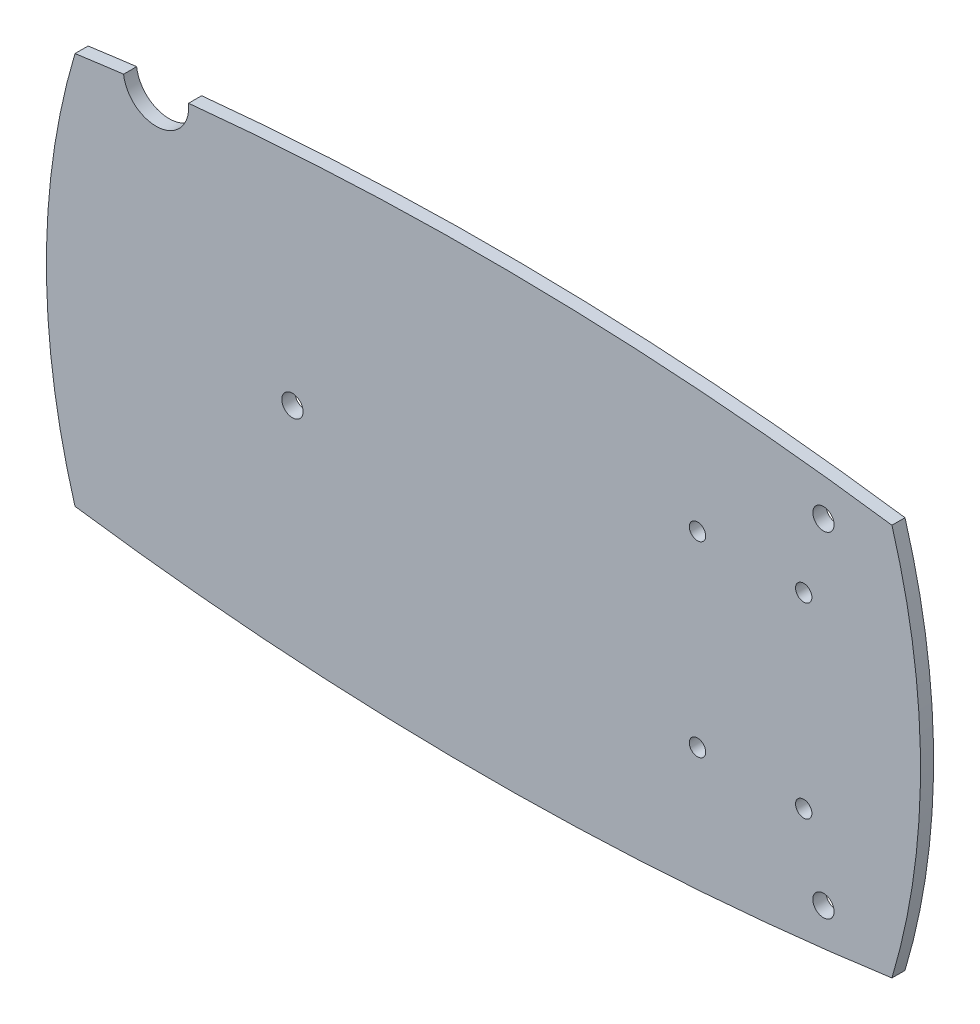
ISO-10303-21;
HEADER;
FILE_DESCRIPTION(('STEP AP214'),'2;1');
FILE_NAME('part.step','',(''),(''),'','','');
FILE_SCHEMA(('AUTOMOTIVE_DESIGN { 1 0 10303 214 1 1 1 1 }'));
ENDSEC;
DATA;
#1=APPLICATION_CONTEXT('core data for automotive mechanical design processes');
#2=APPLICATION_PROTOCOL_DEFINITION('international standard','automotive_design',2000,#1);
#3=PRODUCT_CONTEXT('',#1,'mechanical');
#4=PRODUCT('Part','Part','',(#3));
#5=PRODUCT_RELATED_PRODUCT_CATEGORY('part','',(#4));
#6=PRODUCT_DEFINITION_FORMATION('','',#4);
#7=PRODUCT_DEFINITION_CONTEXT('part definition',#1,'design');
#8=PRODUCT_DEFINITION('design','',#6,#7);
#9=PRODUCT_DEFINITION_SHAPE('','',#8);
#10=(LENGTH_UNIT() NAMED_UNIT(*) SI_UNIT(.MILLI.,.METRE.));
#11=(NAMED_UNIT(*) PLANE_ANGLE_UNIT() SI_UNIT($,.RADIAN.));
#12=(NAMED_UNIT(*) SI_UNIT($,.STERADIAN.) SOLID_ANGLE_UNIT());
#13=UNCERTAINTY_MEASURE_WITH_UNIT(LENGTH_MEASURE(1.E-05),#10,'distance_accuracy_value','');
#14=(GEOMETRIC_REPRESENTATION_CONTEXT(3) GLOBAL_UNCERTAINTY_ASSIGNED_CONTEXT((#13)) GLOBAL_UNIT_ASSIGNED_CONTEXT((#10,
#11,#12)) REPRESENTATION_CONTEXT('',''));
#15=CARTESIAN_POINT('',(0.,0.,0.));
#16=DIRECTION('',(0.,0.,1.));
#17=DIRECTION('',(1.,0.,0.));
#18=AXIS2_PLACEMENT_3D('',#15,#16,#17);
#19=CARTESIAN_POINT('',(-1.184910226,11.2255424561,1.6));
#20=DIRECTION('',(0.,0.,1.));
#21=DIRECTION('',(1.,0.,0.));
#22=AXIS2_PLACEMENT_3D('',#19,#20,#21);
#23=PLANE('',#22);
#24=CARTESIAN_POINT('',(26.6173845785,0.,1.6));
#25=DIRECTION('',(0.,0.,1.));
#26=DIRECTION('',(1.,0.,0.));
#27=AXIS2_PLACEMENT_3D('',#24,#25,#26);
#28=CIRCLE('',#27,1.3);
#29=CARTESIAN_POINT('',(27.9173845785,0.,1.6));
#30=VERTEX_POINT('',#29);
#31=EDGE_CURVE('E121',#30,#30,#28,.F.);
#32=ORIENTED_EDGE('',*,*,#31,.T.);
#33=EDGE_LOOP('',(#32));
#34=FACE_BOUND('',#33,.T.);
#35=CARTESIAN_POINT('',(91.6173845785,20.5,1.60000000083001));
#36=DIRECTION('',(0.,0.,1.));
#37=DIRECTION('',(1.,0.,0.));
#38=AXIS2_PLACEMENT_3D('',#35,#36,#37);
#39=CIRCLE('',#38,1.3);
#40=CARTESIAN_POINT('',(92.9173845785,20.5,1.60000000083001));
#41=VERTEX_POINT('',#40);
#42=EDGE_CURVE('E124',#41,#41,#39,.F.);
#43=ORIENTED_EDGE('',*,*,#42,.T.);
#44=EDGE_LOOP('',(#43));
#45=FACE_BOUND('',#44,.T.);
#46=CARTESIAN_POINT('',(91.6173845785,-20.5,1.60000000083001));
#47=DIRECTION('',(0.,0.,1.));
#48=DIRECTION('',(1.,0.,0.));
#49=AXIS2_PLACEMENT_3D('',#46,#47,#48);
#50=CIRCLE('',#49,1.3);
#51=CARTESIAN_POINT('',(92.9173845785,-20.5,1.60000000083001));
#52=VERTEX_POINT('',#51);
#53=EDGE_CURVE('E127',#52,#52,#50,.F.);
#54=ORIENTED_EDGE('',*,*,#53,.T.);
#55=EDGE_LOOP('',(#54));
#56=FACE_BOUND('',#55,.T.);
#57=CARTESIAN_POINT('',(89.2,-11.45,1.60000000066));
#58=DIRECTION('',(0.,0.,-1.));
#59=DIRECTION('',(-1.,0.,0.));
#60=AXIS2_PLACEMENT_3D('',#57,#58,#59);
#61=CIRCLE('',#60,1.);
#62=CARTESIAN_POINT('',(88.2,-11.45,1.60000000066));
#63=VERTEX_POINT('',#62);
#64=EDGE_CURVE('E130',#63,#63,#61,.T.);
#65=ORIENTED_EDGE('',*,*,#64,.T.);
#66=EDGE_LOOP('',(#65));
#67=FACE_BOUND('',#66,.T.);
#68=CARTESIAN_POINT('',(76.2,-11.45,1.60000000066));
#69=DIRECTION('',(0.,0.,-1.));
#70=DIRECTION('',(-1.,0.,0.));
#71=AXIS2_PLACEMENT_3D('',#68,#69,#70);
#72=CIRCLE('',#71,1.);
#73=CARTESIAN_POINT('',(75.2,-11.45,1.60000000066));
#74=VERTEX_POINT('',#73);
#75=EDGE_CURVE('E133',#74,#74,#72,.T.);
#76=ORIENTED_EDGE('',*,*,#75,.T.);
#77=EDGE_LOOP('',(#76));
#78=FACE_BOUND('',#77,.T.);
#79=CARTESIAN_POINT('',(76.2,11.45,1.60000000066));
#80=DIRECTION('',(0.,0.,-1.));
#81=DIRECTION('',(-1.,0.,0.));
#82=AXIS2_PLACEMENT_3D('',#79,#80,#81);
#83=CIRCLE('',#82,1.);
#84=CARTESIAN_POINT('',(75.2,11.45,1.60000000066));
#85=VERTEX_POINT('',#84);
#86=EDGE_CURVE('E136',#85,#85,#83,.T.);
#87=ORIENTED_EDGE('',*,*,#86,.T.);
#88=EDGE_LOOP('',(#87));
#89=FACE_BOUND('',#88,.T.);
#90=CARTESIAN_POINT('',(89.2,11.45,1.60000000066));
#91=DIRECTION('',(0.,0.,-1.));
#92=DIRECTION('',(-1.,0.,0.));
#93=AXIS2_PLACEMENT_3D('',#90,#91,#92);
#94=CIRCLE('',#93,1.);
#95=CARTESIAN_POINT('',(88.2,11.45,1.60000000066));
#96=VERTEX_POINT('',#95);
#97=EDGE_CURVE('E139',#96,#96,#94,.T.);
#98=ORIENTED_EDGE('',*,*,#97,.T.);
#99=EDGE_LOOP('',(#98));
#100=FACE_BOUND('',#99,.T.);
#101=CARTESIAN_POINT('',(19.4642857143,0.,1.59999999963));
#102=DIRECTION('',(0.,0.,-1.));
#103=DIRECTION('',(-1.,0.,0.));
#104=AXIS2_PLACEMENT_3D('',#101,#102,#103);
#105=CIRCLE('',#104,84.0357142857);
#106=CARTESIAN_POINT('',(99.9999999999995,24.0000000000014,1.59999999963));
#107=VERTEX_POINT('',#106);
#108=CARTESIAN_POINT('',(99.9999999999992,-24.0000000000007,1.59999999963));
#109=VERTEX_POINT('',#108);
#110=EDGE_CURVE('E148',#107,#109,#105,.T.);
#111=ORIENTED_EDGE('',*,*,#110,.F.);
#112=CARTESIAN_POINT('',(50.,-331.392857143,1.6));
#113=DIRECTION('',(0.,0.,1.));
#114=DIRECTION('',(1.,0.,0.));
#115=AXIS2_PLACEMENT_3D('',#112,#113,#114);
#116=CIRCLE('',#115,358.892857143);
#117=CARTESIAN_POINT('',(13.8981014505967,25.6795946499009,1.6));
#118=VERTEX_POINT('',#117);
#119=EDGE_CURVE('E145',#118,#107,#116,.F.);
#120=ORIENTED_EDGE('',*,*,#119,.F.);
#121=CARTESIAN_POINT('',(9.92069465196,25.2550535351,1.6));
#122=DIRECTION('',(0.,0.,-1.));
#123=DIRECTION('',(-1.,0.,0.));
#124=AXIS2_PLACEMENT_3D('',#121,#122,#123);
#125=CIRCLE('',#124,4.);
#126=CARTESIAN_POINT('',(5.94826649118717,24.7862097364879,1.59999999981499));
#127=VERTEX_POINT('',#126);
#128=EDGE_CURVE('E80',#118,#127,#125,.T.);
#129=ORIENTED_EDGE('',*,*,#128,.T.);
#130=CARTESIAN_POINT('',(50.,-331.392857143,1.59999999963));
#131=DIRECTION('',(0.,0.,1.));
#132=DIRECTION('',(1.,0.,0.));
#133=AXIS2_PLACEMENT_3D('',#130,#131,#132);
#134=CIRCLE('',#133,358.892857143);
#135=CARTESIAN_POINT('',(8.11850586757146E-13,24.0000000000007,1.59999999963));
#136=VERTEX_POINT('',#135);
#137=EDGE_CURVE('E19',#136,#127,#134,.F.);
#138=ORIENTED_EDGE('',*,*,#137,.F.);
#139=CARTESIAN_POINT('',(80.5357142857,0.,1.59999999963));
#140=DIRECTION('',(0.,0.,1.));
#141=DIRECTION('',(1.,0.,0.));
#142=AXIS2_PLACEMENT_3D('',#139,#140,#141);
#143=CIRCLE('',#142,84.0357142857);
#144=CARTESIAN_POINT('',(5.96744875736022E-13,-24.0000000000014,1.59999999963));
#145=VERTEX_POINT('',#144);
#146=EDGE_CURVE('E66',#145,#136,#143,.F.);
#147=ORIENTED_EDGE('',*,*,#146,.F.);
#148=CARTESIAN_POINT('',(50.,331.392857143,1.59999999963));
#149=DIRECTION('',(0.,0.,-1.));
#150=DIRECTION('',(-1.,0.,0.));
#151=AXIS2_PLACEMENT_3D('',#148,#149,#150);
#152=CIRCLE('',#151,358.892857143);
#153=EDGE_CURVE('E88',#109,#145,#152,.T.);
#154=ORIENTED_EDGE('',*,*,#153,.F.);
#155=EDGE_LOOP('',(#111,#120,#129,#138,#147,#154));
#156=FACE_BOUND('',#155,.T.);
#157=ADVANCED_FACE('F16',(#34,#45,#56,#67,#78,#89,#100,#156),#23,.T.);
#158=CARTESIAN_POINT('',(50.,-331.392857143,0.));
#159=DIRECTION('',(0.,0.,1.));
#160=DIRECTION('',(1.,0.,0.));
#161=AXIS2_PLACEMENT_3D('',#158,#159,#160);
#162=CYLINDRICAL_SURFACE('',#161,358.892857143);
#163=DIRECTION('',(0.,0.,1.));
#164=VECTOR('',#163,1.);
#165=CARTESIAN_POINT('',(5.55111512312578E-13,23.9999999999998,0.));
#166=LINE('',#165,#164);
#167=CARTESIAN_POINT('',(8.11850586757146E-13,24.0000000000007,1.77024438456849E-10));
#168=VERTEX_POINT('',#167);
#169=EDGE_CURVE('E71',#136,#168,#166,.F.);
#170=ORIENTED_EDGE('',*,*,#169,.F.);
#171=ORIENTED_EDGE('',*,*,#137,.T.);
#172=DIRECTION('',(0.,0.,-1.));
#173=VECTOR('',#172,1.);
#174=CARTESIAN_POINT('',(5.94826649118556,24.7862097364995,1.6));
#175=LINE('',#174,#173);
#176=CARTESIAN_POINT('',(5.94826649118717,24.7862097364879,3.7252904754258E-10));
#177=VERTEX_POINT('',#176);
#178=EDGE_CURVE('E142',#127,#177,#175,.T.);
#179=ORIENTED_EDGE('',*,*,#178,.T.);
#180=CARTESIAN_POINT('',(50.,-331.392857143,3.72529118664E-10));
#181=DIRECTION('',(0.,0.,1.));
#182=DIRECTION('',(1.,0.,0.));
#183=AXIS2_PLACEMENT_3D('',#180,#181,#182);
#184=CIRCLE('',#183,358.892857143);
#185=EDGE_CURVE('E86',#177,#168,#184,.T.);
#186=ORIENTED_EDGE('',*,*,#185,.T.);
#187=EDGE_LOOP('',(#170,#171,#179,#186));
#188=FACE_BOUND('',#187,.T.);
#189=ADVANCED_FACE('F85',(#188),#162,.T.);
#190=CARTESIAN_POINT('',(80.5357142857,0.,0.));
#191=DIRECTION('',(0.,0.,1.));
#192=DIRECTION('',(1.,0.,0.));
#193=AXIS2_PLACEMENT_3D('',#190,#191,#192);
#194=CYLINDRICAL_SURFACE('',#193,84.0357142857);
#195=CARTESIAN_POINT('',(80.5357142857,0.,0.));
#196=DIRECTION('',(0.,0.,1.));
#197=DIRECTION('',(1.,0.,0.));
#198=AXIS2_PLACEMENT_3D('',#195,#196,#197);
#199=CIRCLE('',#198,84.0357142857);
#200=CARTESIAN_POINT('',(5.96744875736022E-13,-24.0000000000014,0.));
#201=VERTEX_POINT('',#200);
#202=EDGE_CURVE('E118',#168,#201,#199,.T.);
#203=ORIENTED_EDGE('',*,*,#202,.T.);
#204=DIRECTION('',(0.,0.,-1.));
#205=VECTOR('',#204,1.);
#206=CARTESIAN_POINT('',(0.,-24.0000000000014,0.));
#207=LINE('',#206,#205);
#208=EDGE_CURVE('E73',#145,#201,#207,.T.);
#209=ORIENTED_EDGE('',*,*,#208,.F.);
#210=ORIENTED_EDGE('',*,*,#146,.T.);
#211=ORIENTED_EDGE('',*,*,#169,.T.);
#212=EDGE_LOOP('',(#203,#209,#210,#211));
#213=FACE_BOUND('',#212,.T.);
#214=ADVANCED_FACE('F69',(#213),#194,.T.);
#215=CARTESIAN_POINT('',(50.,331.392857143,0.));
#216=DIRECTION('',(0.,0.,-1.));
#217=DIRECTION('',(-1.,0.,0.));
#218=AXIS2_PLACEMENT_3D('',#215,#216,#217);
#219=CYLINDRICAL_SURFACE('',#218,358.892857143);
#220=DIRECTION('',(0.,0.,-1.));
#221=VECTOR('',#220,1.);
#222=CARTESIAN_POINT('',(99.9999999999994,-23.9999999999998,0.));
#223=LINE('',#222,#221);
#224=CARTESIAN_POINT('',(99.9999999999992,-24.0000000000007,0.));
#225=VERTEX_POINT('',#224);
#226=EDGE_CURVE('E150',#109,#225,#223,.T.);
#227=ORIENTED_EDGE('',*,*,#226,.F.);
#228=ORIENTED_EDGE('',*,*,#153,.T.);
#229=ORIENTED_EDGE('',*,*,#208,.T.);
#230=CARTESIAN_POINT('',(50.,331.392857143,0.));
#231=DIRECTION('',(0.,0.,-1.));
#232=DIRECTION('',(-1.,0.,0.));
#233=AXIS2_PLACEMENT_3D('',#230,#231,#232);
#234=CIRCLE('',#233,358.892857143);
#235=EDGE_CURVE('E116',#201,#225,#234,.F.);
#236=ORIENTED_EDGE('',*,*,#235,.T.);
#237=EDGE_LOOP('',(#227,#228,#229,#236));
#238=FACE_BOUND('',#237,.T.);
#239=ADVANCED_FACE('F153',(#238),#219,.T.);
#240=CARTESIAN_POINT('',(19.4642857143,0.,0.));
#241=DIRECTION('',(0.,0.,-1.));
#242=DIRECTION('',(-1.,0.,0.));
#243=AXIS2_PLACEMENT_3D('',#240,#241,#242);
#244=CYLINDRICAL_SURFACE('',#243,84.0357142857);
#245=CARTESIAN_POINT('',(19.4642857143,0.,0.));
#246=DIRECTION('',(0.,0.,-1.));
#247=DIRECTION('',(-1.,0.,0.));
#248=AXIS2_PLACEMENT_3D('',#245,#246,#247);
#249=CIRCLE('',#248,84.0357142857);
#250=CARTESIAN_POINT('',(99.9999999999995,24.0000000000014,0.));
#251=VERTEX_POINT('',#250);
#252=EDGE_CURVE('E113',#225,#251,#249,.F.);
#253=ORIENTED_EDGE('',*,*,#252,.T.);
#254=DIRECTION('',(0.,0.,1.));
#255=VECTOR('',#254,1.);
#256=CARTESIAN_POINT('',(100.,24.0000000000014,0.));
#257=LINE('',#256,#255);
#258=EDGE_CURVE('E147',#107,#251,#257,.F.);
#259=ORIENTED_EDGE('',*,*,#258,.F.);
#260=ORIENTED_EDGE('',*,*,#110,.T.);
#261=ORIENTED_EDGE('',*,*,#226,.T.);
#262=EDGE_LOOP('',(#253,#259,#260,#261));
#263=FACE_BOUND('',#262,.T.);
#264=ADVANCED_FACE('F158',(#263),#244,.T.);
#265=CARTESIAN_POINT('',(50.,-331.392857143,0.));
#266=DIRECTION('',(0.,0.,1.));
#267=DIRECTION('',(1.,0.,0.));
#268=AXIS2_PLACEMENT_3D('',#265,#266,#267);
#269=CYLINDRICAL_SURFACE('',#268,358.892857143);
#270=DIRECTION('',(0.,0.,-1.));
#271=VECTOR('',#270,1.);
#272=CARTESIAN_POINT('',(13.8981014505971,25.6795946498997,1.6));
#273=LINE('',#272,#271);
#274=CARTESIAN_POINT('',(13.8981014505971,25.6795946498997,1.86264523770185E-10));
#275=VERTEX_POINT('',#274);
#276=EDGE_CURVE('E144',#275,#118,#273,.F.);
#277=ORIENTED_EDGE('',*,*,#276,.T.);
#278=ORIENTED_EDGE('',*,*,#119,.T.);
#279=ORIENTED_EDGE('',*,*,#258,.T.);
#280=CARTESIAN_POINT('',(50.,-331.392857143,0.));
#281=DIRECTION('',(0.,0.,1.));
#282=DIRECTION('',(1.,0.,0.));
#283=AXIS2_PLACEMENT_3D('',#280,#281,#282);
#284=CIRCLE('',#283,358.892857143);
#285=EDGE_CURVE('E34',#251,#275,#284,.T.);
#286=ORIENTED_EDGE('',*,*,#285,.T.);
#287=EDGE_LOOP('',(#277,#278,#279,#286));
#288=FACE_BOUND('',#287,.T.);
#289=ADVANCED_FACE('F207',(#288),#269,.T.);
#290=CARTESIAN_POINT('',(9.92069465196,25.2550535351,1.6));
#291=DIRECTION('',(0.,0.,-1.));
#292=DIRECTION('',(-1.,0.,0.));
#293=AXIS2_PLACEMENT_3D('',#290,#291,#292);
#294=CYLINDRICAL_SURFACE('',#293,4.);
#295=ORIENTED_EDGE('',*,*,#178,.F.);
#296=ORIENTED_EDGE('',*,*,#128,.F.);
#297=ORIENTED_EDGE('',*,*,#276,.F.);
#298=CARTESIAN_POINT('',(9.92069465196,25.2550535351,3.72529047540371E-10));
#299=DIRECTION('',(0.,0.,-1.));
#300=DIRECTION('',(-1.,0.,0.));
#301=AXIS2_PLACEMENT_3D('',#298,#299,#300);
#302=CIRCLE('',#301,4.);
#303=EDGE_CURVE('E109',#275,#177,#302,.T.);
#304=ORIENTED_EDGE('',*,*,#303,.T.);
#305=EDGE_LOOP('',(#295,#296,#297,#304));
#306=FACE_BOUND('',#305,.T.);
#307=ADVANCED_FACE('F165',(#306),#294,.F.);
#308=CARTESIAN_POINT('',(89.2,11.45,120.318577119));
#309=DIRECTION('',(0.,0.,-1.));
#310=DIRECTION('',(-1.,0.,0.));
#311=AXIS2_PLACEMENT_3D('',#308,#309,#310);
#312=CYLINDRICAL_SURFACE('',#311,1.);
#313=CARTESIAN_POINT('',(89.2,11.45,-8.34582403186346E-10));
#314=DIRECTION('',(0.,0.,-1.));
#315=DIRECTION('',(-1.,0.,0.));
#316=AXIS2_PLACEMENT_3D('',#313,#314,#315);
#317=CIRCLE('',#316,1.);
#318=CARTESIAN_POINT('',(88.2,11.45,-8.34582403186346E-10));
#319=VERTEX_POINT('',#318);
#320=EDGE_CURVE('E106',#319,#319,#317,.T.);
#321=ORIENTED_EDGE('',*,*,#320,.T.);
#322=EDGE_LOOP('',(#321));
#323=FACE_BOUND('',#322,.T.);
#324=ORIENTED_EDGE('',*,*,#97,.F.);
#325=EDGE_LOOP('',(#324));
#326=FACE_BOUND('',#325,.T.);
#327=ADVANCED_FACE('F200',(#323,#326),#312,.F.);
#328=CARTESIAN_POINT('',(76.2,11.45,120.318577119));
#329=DIRECTION('',(0.,0.,-1.));
#330=DIRECTION('',(-1.,0.,0.));
#331=AXIS2_PLACEMENT_3D('',#328,#329,#330);
#332=CYLINDRICAL_SURFACE('',#331,1.);
#333=CARTESIAN_POINT('',(76.2,11.45,-8.34582403186346E-10));
#334=DIRECTION('',(0.,0.,-1.));
#335=DIRECTION('',(-1.,0.,0.));
#336=AXIS2_PLACEMENT_3D('',#333,#334,#335);
#337=CIRCLE('',#336,1.);
#338=CARTESIAN_POINT('',(75.2,11.45,-8.34582403186346E-10));
#339=VERTEX_POINT('',#338);
#340=EDGE_CURVE('E103',#339,#339,#337,.T.);
#341=ORIENTED_EDGE('',*,*,#340,.T.);
#342=EDGE_LOOP('',(#341));
#343=FACE_BOUND('',#342,.T.);
#344=ORIENTED_EDGE('',*,*,#86,.F.);
#345=EDGE_LOOP('',(#344));
#346=FACE_BOUND('',#345,.T.);
#347=ADVANCED_FACE('F196',(#343,#346),#332,.F.);
#348=CARTESIAN_POINT('',(76.2,-11.45,120.318577119));
#349=DIRECTION('',(0.,0.,-1.));
#350=DIRECTION('',(-1.,0.,0.));
#351=AXIS2_PLACEMENT_3D('',#348,#349,#350);
#352=CYLINDRICAL_SURFACE('',#351,1.);
#353=CARTESIAN_POINT('',(76.2,-11.45,-8.34582403186346E-10));
#354=DIRECTION('',(0.,0.,-1.));
#355=DIRECTION('',(-1.,0.,0.));
#356=AXIS2_PLACEMENT_3D('',#353,#354,#355);
#357=CIRCLE('',#356,1.);
#358=CARTESIAN_POINT('',(75.2,-11.45,-8.34582403186346E-10));
#359=VERTEX_POINT('',#358);
#360=EDGE_CURVE('E100',#359,#359,#357,.T.);
#361=ORIENTED_EDGE('',*,*,#360,.T.);
#362=EDGE_LOOP('',(#361));
#363=FACE_BOUND('',#362,.T.);
#364=ORIENTED_EDGE('',*,*,#75,.F.);
#365=EDGE_LOOP('',(#364));
#366=FACE_BOUND('',#365,.T.);
#367=ADVANCED_FACE('F192',(#363,#366),#352,.F.);
#368=CARTESIAN_POINT('',(89.2,-11.45,120.318577119));
#369=DIRECTION('',(0.,0.,-1.));
#370=DIRECTION('',(-1.,0.,0.));
#371=AXIS2_PLACEMENT_3D('',#368,#369,#370);
#372=CYLINDRICAL_SURFACE('',#371,1.);
#373=CARTESIAN_POINT('',(89.2,-11.45,-8.34582403186346E-10));
#374=DIRECTION('',(0.,0.,-1.));
#375=DIRECTION('',(-1.,0.,0.));
#376=AXIS2_PLACEMENT_3D('',#373,#374,#375);
#377=CIRCLE('',#376,1.);
#378=CARTESIAN_POINT('',(88.2,-11.45,-8.34582403186346E-10));
#379=VERTEX_POINT('',#378);
#380=EDGE_CURVE('E97',#379,#379,#377,.T.);
#381=ORIENTED_EDGE('',*,*,#380,.T.);
#382=EDGE_LOOP('',(#381));
#383=FACE_BOUND('',#382,.T.);
#384=ORIENTED_EDGE('',*,*,#64,.F.);
#385=EDGE_LOOP('',(#384));
#386=FACE_BOUND('',#385,.T.);
#387=ADVANCED_FACE('F188',(#383,#386),#372,.F.);
#388=CARTESIAN_POINT('',(91.6173845785,-20.5,-118.718577119));
#389=DIRECTION('',(0.,0.,1.));
#390=DIRECTION('',(1.,0.,0.));
#391=AXIS2_PLACEMENT_3D('',#388,#389,#390);
#392=CYLINDRICAL_SURFACE('',#391,1.3);
#393=ORIENTED_EDGE('',*,*,#53,.F.);
#394=EDGE_LOOP('',(#393));
#395=FACE_BOUND('',#394,.T.);
#396=CARTESIAN_POINT('',(91.6173845785,-20.5,-6.55531184889924E-10));
#397=DIRECTION('',(0.,0.,1.));
#398=DIRECTION('',(1.,0.,0.));
#399=AXIS2_PLACEMENT_3D('',#396,#397,#398);
#400=CIRCLE('',#399,1.3);
#401=CARTESIAN_POINT('',(92.9173845785,-20.5,-6.55531184889924E-10));
#402=VERTEX_POINT('',#401);
#403=EDGE_CURVE('E94',#402,#402,#400,.F.);
#404=ORIENTED_EDGE('',*,*,#403,.T.);
#405=EDGE_LOOP('',(#404));
#406=FACE_BOUND('',#405,.T.);
#407=ADVANCED_FACE('F184',(#395,#406),#392,.F.);
#408=CARTESIAN_POINT('',(91.6173845785,20.5,-118.718577119));
#409=DIRECTION('',(0.,0.,1.));
#410=DIRECTION('',(1.,0.,0.));
#411=AXIS2_PLACEMENT_3D('',#408,#409,#410);
#412=CYLINDRICAL_SURFACE('',#411,1.3);
#413=ORIENTED_EDGE('',*,*,#42,.F.);
#414=EDGE_LOOP('',(#413));
#415=FACE_BOUND('',#414,.T.);
#416=CARTESIAN_POINT('',(91.6173845785,20.5,-6.55531184889924E-10));
#417=DIRECTION('',(0.,0.,1.));
#418=DIRECTION('',(1.,0.,0.));
#419=AXIS2_PLACEMENT_3D('',#416,#417,#418);
#420=CIRCLE('',#419,1.3);
#421=CARTESIAN_POINT('',(92.9173845785,20.5,-6.55531184889924E-10));
#422=VERTEX_POINT('',#421);
#423=EDGE_CURVE('E25',#422,#422,#420,.F.);
#424=ORIENTED_EDGE('',*,*,#423,.T.);
#425=EDGE_LOOP('',(#424));
#426=FACE_BOUND('',#425,.T.);
#427=ADVANCED_FACE('F176',(#415,#426),#412,.F.);
#428=CARTESIAN_POINT('',(26.6173845785,0.,-118.718577119));
#429=DIRECTION('',(0.,0.,1.));
#430=DIRECTION('',(1.,0.,0.));
#431=AXIS2_PLACEMENT_3D('',#428,#429,#430);
#432=CYLINDRICAL_SURFACE('',#431,1.3);
#433=ORIENTED_EDGE('',*,*,#31,.F.);
#434=EDGE_LOOP('',(#433));
#435=FACE_BOUND('',#434,.T.);
#436=CARTESIAN_POINT('',(26.6173845785,0.,-6.55531184889924E-10));
#437=DIRECTION('',(0.,0.,1.));
#438=DIRECTION('',(1.,0.,0.));
#439=AXIS2_PLACEMENT_3D('',#436,#437,#438);
#440=CIRCLE('',#439,1.3);
#441=CARTESIAN_POINT('',(27.9173845785,0.,-6.55531184889924E-10));
#442=VERTEX_POINT('',#441);
#443=EDGE_CURVE('E11',#442,#442,#440,.F.);
#444=ORIENTED_EDGE('',*,*,#443,.T.);
#445=EDGE_LOOP('',(#444));
#446=FACE_BOUND('',#445,.T.);
#447=ADVANCED_FACE('F169',(#435,#446),#432,.F.);
#448=CARTESIAN_POINT('',(-1.184910226,11.2255424561,0.));
#449=DIRECTION('',(0.,0.,1.));
#450=DIRECTION('',(1.,0.,0.));
#451=AXIS2_PLACEMENT_3D('',#448,#449,#450);
#452=PLANE('',#451);
#453=ORIENTED_EDGE('',*,*,#443,.F.);
#454=EDGE_LOOP('',(#453));
#455=FACE_BOUND('',#454,.T.);
#456=ORIENTED_EDGE('',*,*,#423,.F.);
#457=EDGE_LOOP('',(#456));
#458=FACE_BOUND('',#457,.T.);
#459=ORIENTED_EDGE('',*,*,#403,.F.);
#460=EDGE_LOOP('',(#459));
#461=FACE_BOUND('',#460,.T.);
#462=ORIENTED_EDGE('',*,*,#380,.F.);
#463=EDGE_LOOP('',(#462));
#464=FACE_BOUND('',#463,.T.);
#465=ORIENTED_EDGE('',*,*,#360,.F.);
#466=EDGE_LOOP('',(#465));
#467=FACE_BOUND('',#466,.T.);
#468=ORIENTED_EDGE('',*,*,#340,.F.);
#469=EDGE_LOOP('',(#468));
#470=FACE_BOUND('',#469,.T.);
#471=ORIENTED_EDGE('',*,*,#320,.F.);
#472=EDGE_LOOP('',(#471));
#473=FACE_BOUND('',#472,.T.);
#474=ORIENTED_EDGE('',*,*,#303,.F.);
#475=ORIENTED_EDGE('',*,*,#285,.F.);
#476=ORIENTED_EDGE('',*,*,#252,.F.);
#477=ORIENTED_EDGE('',*,*,#235,.F.);
#478=ORIENTED_EDGE('',*,*,#202,.F.);
#479=ORIENTED_EDGE('',*,*,#185,.F.);
#480=EDGE_LOOP('',(#474,#475,#476,#477,#478,#479));
#481=FACE_BOUND('',#480,.T.);
#482=ADVANCED_FACE('F167',(#455,#458,#461,#464,#467,#470,#473,#481),#452,.F.);
#483=CLOSED_SHELL('',(#157,#189,#214,#239,#264,#289,#307,#327,#347,#367,#387,#407,#427,#447,#482));
#484=MANIFOLD_SOLID_BREP('B1',#483);
#485=ADVANCED_BREP_SHAPE_REPRESENTATION('',(#18,#484),#14);
#486=SHAPE_DEFINITION_REPRESENTATION(#9,#485);
ENDSEC;
END-ISO-10303-21;
